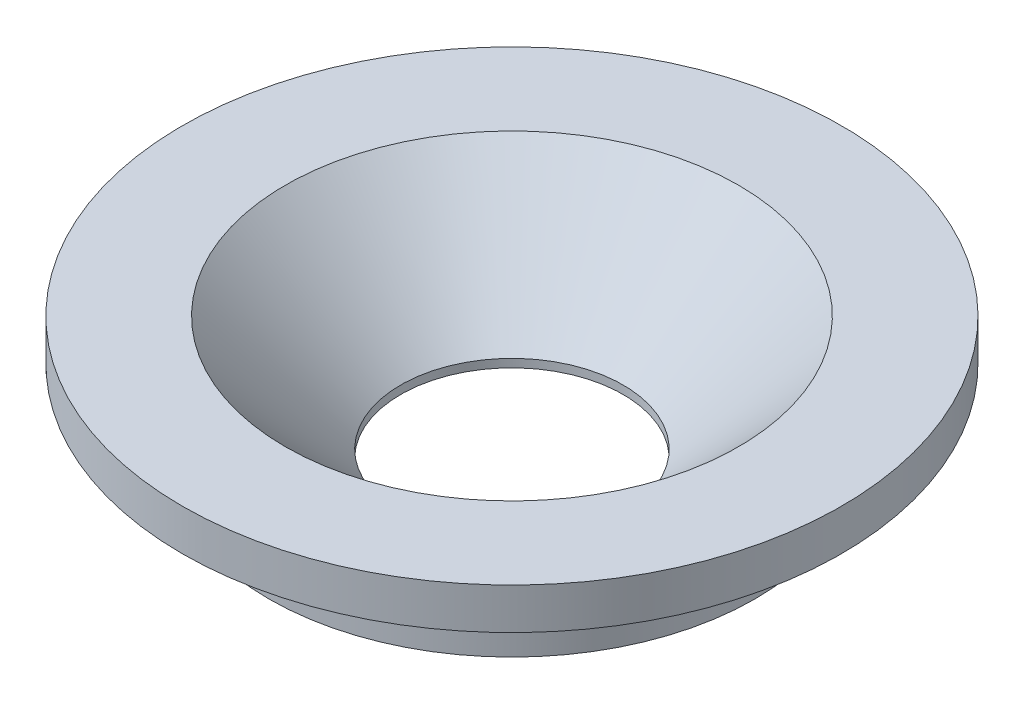
ISO-10303-21;
HEADER;
FILE_DESCRIPTION(('STEP AP214'),'2;1');
FILE_NAME('part.step','',(''),(''),'','','');
FILE_SCHEMA(('AUTOMOTIVE_DESIGN { 1 0 10303 214 1 1 1 1 }'));
ENDSEC;
DATA;
#1=APPLICATION_CONTEXT('core data for automotive mechanical design processes');
#2=APPLICATION_PROTOCOL_DEFINITION('international standard','automotive_design',2000,#1);
#3=PRODUCT_CONTEXT('',#1,'mechanical');
#4=PRODUCT('Part','Part','',(#3));
#5=PRODUCT_RELATED_PRODUCT_CATEGORY('part','',(#4));
#6=PRODUCT_DEFINITION_FORMATION('','',#4);
#7=PRODUCT_DEFINITION_CONTEXT('part definition',#1,'design');
#8=PRODUCT_DEFINITION('design','',#6,#7);
#9=PRODUCT_DEFINITION_SHAPE('','',#8);
#10=(LENGTH_UNIT() NAMED_UNIT(*) SI_UNIT(.MILLI.,.METRE.));
#11=(NAMED_UNIT(*) PLANE_ANGLE_UNIT() SI_UNIT($,.RADIAN.));
#12=(NAMED_UNIT(*) SI_UNIT($,.STERADIAN.) SOLID_ANGLE_UNIT());
#13=UNCERTAINTY_MEASURE_WITH_UNIT(LENGTH_MEASURE(1.E-05),#10,'distance_accuracy_value','');
#14=(GEOMETRIC_REPRESENTATION_CONTEXT(3) GLOBAL_UNCERTAINTY_ASSIGNED_CONTEXT((#13)) GLOBAL_UNIT_ASSIGNED_CONTEXT((#10,
#11,#12)) REPRESENTATION_CONTEXT('',''));
#15=CARTESIAN_POINT('',(0.,0.,0.));
#16=DIRECTION('',(0.,0.,1.));
#17=DIRECTION('',(1.,0.,0.));
#18=AXIS2_PLACEMENT_3D('',#15,#16,#17);
#19=CARTESIAN_POINT('',(0.,1.,0.));
#20=DIRECTION('',(0.,-1.,0.));
#21=DIRECTION('',(0.,0.,-1.));
#22=AXIS2_PLACEMENT_3D('',#19,#20,#21);
#23=CYLINDRICAL_SURFACE('',#22,2.95);
#24=CARTESIAN_POINT('',(0.,1.,0.));
#25=DIRECTION('',(0.,1.,0.));
#26=DIRECTION('',(0.,0.,1.));
#27=AXIS2_PLACEMENT_3D('',#24,#25,#26);
#28=CIRCLE('',#27,2.95);
#29=CARTESIAN_POINT('',(0.,1.,2.95));
#30=VERTEX_POINT('',#29);
#31=EDGE_CURVE('E10',#30,#30,#28,.T.);
#32=ORIENTED_EDGE('',*,*,#31,.F.);
#33=EDGE_LOOP('',(#32));
#34=FACE_BOUND('',#33,.T.);
#35=CARTESIAN_POINT('',(0.,0.,0.));
#36=DIRECTION('',(0.,1.,0.));
#37=DIRECTION('',(0.,0.,1.));
#38=AXIS2_PLACEMENT_3D('',#35,#36,#37);
#39=CIRCLE('',#38,2.95);
#40=CARTESIAN_POINT('',(0.,0.,2.95));
#41=VERTEX_POINT('',#40);
#42=EDGE_CURVE('E33',#41,#41,#39,.T.);
#43=ORIENTED_EDGE('',*,*,#42,.T.);
#44=EDGE_LOOP('',(#43));
#45=FACE_BOUND('',#44,.T.);
#46=ADVANCED_FACE('F30',(#34,#45),#23,.T.);
#47=CARTESIAN_POINT('',(0.,0.,0.));
#48=DIRECTION('',(0.,1.,0.));
#49=DIRECTION('',(0.,0.,1.));
#50=AXIS2_PLACEMENT_3D('',#47,#48,#49);
#51=PLANE('',#50);
#52=CARTESIAN_POINT('',(0.,0.,0.));
#53=DIRECTION('',(0.,1.,0.));
#54=DIRECTION('',(0.,0.,1.));
#55=AXIS2_PLACEMENT_3D('',#52,#53,#54);
#56=CIRCLE('',#55,1.35);
#57=CARTESIAN_POINT('',(0.,0.,1.35));
#58=VERTEX_POINT('',#57);
#59=EDGE_CURVE('E45',#58,#58,#56,.T.);
#60=ORIENTED_EDGE('',*,*,#59,.T.);
#61=EDGE_LOOP('',(#60));
#62=FACE_BOUND('',#61,.T.);
#63=ORIENTED_EDGE('',*,*,#42,.F.);
#64=EDGE_LOOP('',(#63));
#65=FACE_BOUND('',#64,.T.);
#66=ADVANCED_FACE('F74',(#62,#65),#51,.F.);
#67=CARTESIAN_POINT('',(0.,1.,0.));
#68=DIRECTION('',(0.,1.,0.));
#69=DIRECTION('',(0.,0.,1.));
#70=AXIS2_PLACEMENT_3D('',#67,#68,#69);
#71=PLANE('',#70);
#72=CARTESIAN_POINT('',(0.,1.,0.));
#73=DIRECTION('',(0.,1.,0.));
#74=DIRECTION('',(0.,0.,1.));
#75=AXIS2_PLACEMENT_3D('',#72,#73,#74);
#76=CIRCLE('',#75,4.);
#77=CARTESIAN_POINT('',(0.,1.,4.));
#78=VERTEX_POINT('',#77);
#79=EDGE_CURVE('E42',#78,#78,#76,.T.);
#80=ORIENTED_EDGE('',*,*,#79,.F.);
#81=EDGE_LOOP('',(#80));
#82=FACE_BOUND('',#81,.T.);
#83=ORIENTED_EDGE('',*,*,#31,.T.);
#84=EDGE_LOOP('',(#83));
#85=FACE_BOUND('',#84,.T.);
#86=ADVANCED_FACE('F69',(#82,#85),#71,.F.);
#87=CARTESIAN_POINT('',(0.,1.5,0.));
#88=DIRECTION('',(0.,-1.,0.));
#89=DIRECTION('',(0.,0.,-1.));
#90=AXIS2_PLACEMENT_3D('',#87,#88,#89);
#91=CYLINDRICAL_SURFACE('',#90,4.);
#92=CARTESIAN_POINT('',(0.,1.5,0.));
#93=DIRECTION('',(0.,1.,0.));
#94=DIRECTION('',(0.,0.,1.));
#95=AXIS2_PLACEMENT_3D('',#92,#93,#94);
#96=CIRCLE('',#95,4.);
#97=CARTESIAN_POINT('',(0.,1.5,4.));
#98=VERTEX_POINT('',#97);
#99=EDGE_CURVE('E40',#98,#98,#96,.T.);
#100=ORIENTED_EDGE('',*,*,#99,.F.);
#101=EDGE_LOOP('',(#100));
#102=FACE_BOUND('',#101,.T.);
#103=ORIENTED_EDGE('',*,*,#79,.T.);
#104=EDGE_LOOP('',(#103));
#105=FACE_BOUND('',#104,.T.);
#106=ADVANCED_FACE('F63',(#102,#105),#91,.T.);
#107=CARTESIAN_POINT('',(0.,1.5,0.));
#108=DIRECTION('',(0.,1.,0.));
#109=DIRECTION('',(0.,0.,1.));
#110=AXIS2_PLACEMENT_3D('',#107,#108,#109);
#111=PLANE('',#110);
#112=CARTESIAN_POINT('',(0.,1.5,0.));
#113=DIRECTION('',(0.,1.,0.));
#114=DIRECTION('',(0.,0.,1.));
#115=AXIS2_PLACEMENT_3D('',#112,#113,#114);
#116=CIRCLE('',#115,2.75);
#117=CARTESIAN_POINT('',(0.,1.5,2.75));
#118=VERTEX_POINT('',#117);
#119=EDGE_CURVE('E53',#118,#118,#116,.T.);
#120=ORIENTED_EDGE('',*,*,#119,.F.);
#121=EDGE_LOOP('',(#120));
#122=FACE_BOUND('',#121,.T.);
#123=ORIENTED_EDGE('',*,*,#99,.T.);
#124=EDGE_LOOP('',(#123));
#125=FACE_BOUND('',#124,.T.);
#126=ADVANCED_FACE('F59',(#122,#125),#111,.T.);
#127=CARTESIAN_POINT('',(0.,1.5,0.));
#128=DIRECTION('',(0.,1.,0.));
#129=DIRECTION('',(0.,0.,1.));
#130=AXIS2_PLACEMENT_3D('',#127,#128,#129);
#131=CYLINDRICAL_SURFACE('',#130,1.35);
#132=ORIENTED_EDGE('',*,*,#59,.F.);
#133=EDGE_LOOP('',(#132));
#134=FACE_BOUND('',#133,.T.);
#135=CARTESIAN_POINT('',(0.,0.0999999999999998,0.));
#136=DIRECTION('',(0.,1.,0.));
#137=DIRECTION('',(0.,0.,1.));
#138=AXIS2_PLACEMENT_3D('',#135,#136,#137);
#139=CIRCLE('',#138,1.35);
#140=CARTESIAN_POINT('',(0.,0.0999999999999998,1.35));
#141=VERTEX_POINT('',#140);
#142=EDGE_CURVE('E50',#141,#141,#139,.T.);
#143=ORIENTED_EDGE('',*,*,#142,.T.);
#144=EDGE_LOOP('',(#143));
#145=FACE_BOUND('',#144,.T.);
#146=ADVANCED_FACE('F62',(#134,#145),#131,.F.);
#147=CARTESIAN_POINT('',(0.,1.5,0.));
#148=DIRECTION('',(0.,1.,0.));
#149=DIRECTION('',(0.,0.,1.));
#150=AXIS2_PLACEMENT_3D('',#147,#148,#149);
#151=CONICAL_SURFACE('',#150,2.75,0.785398163397448);
#152=ORIENTED_EDGE('',*,*,#142,.F.);
#153=EDGE_LOOP('',(#152));
#154=FACE_BOUND('',#153,.T.);
#155=ORIENTED_EDGE('',*,*,#119,.T.);
#156=EDGE_LOOP('',(#155));
#157=FACE_BOUND('',#156,.T.);
#158=ADVANCED_FACE('F57',(#154,#157),#151,.F.);
#159=CLOSED_SHELL('',(#46,#66,#86,#106,#126,#146,#158));
#160=MANIFOLD_SOLID_BREP('B2',#159);
#161=ADVANCED_BREP_SHAPE_REPRESENTATION('',(#18,#160),#14);
#162=SHAPE_DEFINITION_REPRESENTATION(#9,#161);
ENDSEC;
END-ISO-10303-21;
